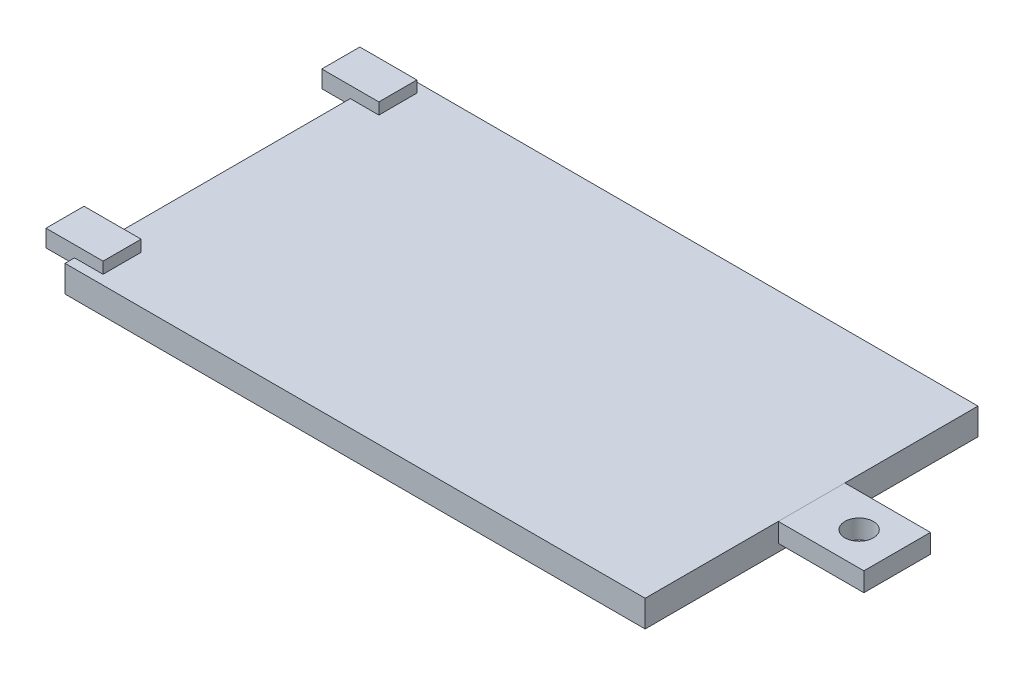
ISO-10303-21;
HEADER;
FILE_DESCRIPTION(('STEP AP214'),'2;1');
FILE_NAME('part.step','',(''),(''),'','','');
FILE_SCHEMA(('AUTOMOTIVE_DESIGN { 1 0 10303 214 1 1 1 1 }'));
ENDSEC;
DATA;
#1=APPLICATION_CONTEXT('core data for automotive mechanical design processes');
#2=APPLICATION_PROTOCOL_DEFINITION('international standard','automotive_design',2000,#1);
#3=PRODUCT_CONTEXT('',#1,'mechanical');
#4=PRODUCT('Part','Part','',(#3));
#5=PRODUCT_RELATED_PRODUCT_CATEGORY('part','',(#4));
#6=PRODUCT_DEFINITION_FORMATION('','',#4);
#7=PRODUCT_DEFINITION_CONTEXT('part definition',#1,'design');
#8=PRODUCT_DEFINITION('design','',#6,#7);
#9=PRODUCT_DEFINITION_SHAPE('','',#8);
#10=(LENGTH_UNIT() NAMED_UNIT(*) SI_UNIT(.MILLI.,.METRE.));
#11=(NAMED_UNIT(*) PLANE_ANGLE_UNIT() SI_UNIT($,.RADIAN.));
#12=(NAMED_UNIT(*) SI_UNIT($,.STERADIAN.) SOLID_ANGLE_UNIT());
#13=UNCERTAINTY_MEASURE_WITH_UNIT(LENGTH_MEASURE(1.E-05),#10,'distance_accuracy_value','');
#14=(GEOMETRIC_REPRESENTATION_CONTEXT(3) GLOBAL_UNCERTAINTY_ASSIGNED_CONTEXT((#13)) GLOBAL_UNIT_ASSIGNED_CONTEXT((#10,
#11,#12)) REPRESENTATION_CONTEXT('',''));
#15=CARTESIAN_POINT('',(0.,0.,0.));
#16=DIRECTION('',(0.,0.,1.));
#17=DIRECTION('',(1.,0.,0.));
#18=AXIS2_PLACEMENT_3D('',#15,#16,#17);
#19=CARTESIAN_POINT('',(0.,0.8,0.));
#20=DIRECTION('',(0.,1.,0.));
#21=DIRECTION('',(0.,0.,1.));
#22=AXIS2_PLACEMENT_3D('',#19,#20,#21);
#23=PLANE('',#22);
#24=DIRECTION('',(0.,0.,-1.));
#25=VECTOR('',#24,1.);
#26=CARTESIAN_POINT('',(61.,0.8,-21.));
#27=LINE('',#26,#25);
#28=CARTESIAN_POINT('',(61.,0.8,-14.));
#29=VERTEX_POINT('',#28);
#30=CARTESIAN_POINT('',(61.,0.8,-21.));
#31=VERTEX_POINT('',#30);
#32=EDGE_CURVE('E99',#29,#31,#27,.T.);
#33=ORIENTED_EDGE('',*,*,#32,.T.);
#34=DIRECTION('',(1.,0.,0.));
#35=VECTOR('',#34,1.);
#36=CARTESIAN_POINT('',(61.,0.8,-21.));
#37=LINE('',#36,#35);
#38=CARTESIAN_POINT('',(70.,0.8,-21.));
#39=VERTEX_POINT('',#38);
#40=EDGE_CURVE('E94',#31,#39,#37,.T.);
#41=ORIENTED_EDGE('',*,*,#40,.T.);
#42=DIRECTION('',(0.,0.,1.));
#43=VECTOR('',#42,1.);
#44=CARTESIAN_POINT('',(70.,0.8,-21.));
#45=LINE('',#44,#43);
#46=CARTESIAN_POINT('',(70.,0.8,-14.));
#47=VERTEX_POINT('',#46);
#48=EDGE_CURVE('E97',#39,#47,#45,.T.);
#49=ORIENTED_EDGE('',*,*,#48,.T.);
#50=DIRECTION('',(-1.,0.,0.));
#51=VECTOR('',#50,1.);
#52=CARTESIAN_POINT('',(61.,0.8,-14.));
#53=LINE('',#52,#51);
#54=EDGE_CURVE('E64',#47,#29,#53,.T.);
#55=ORIENTED_EDGE('',*,*,#54,.T.);
#56=EDGE_LOOP('',(#33,#41,#49,#55));
#57=FACE_BOUND('',#56,.T.);
#58=CARTESIAN_POINT('',(66.,0.8,-17.5));
#59=DIRECTION('',(0.,-1.,0.));
#60=DIRECTION('',(0.,0.,-1.));
#61=AXIS2_PLACEMENT_3D('',#58,#59,#60);
#62=CIRCLE('',#61,1.5);
#63=CARTESIAN_POINT('',(66.,0.8,-19.));
#64=VERTEX_POINT('',#63);
#65=EDGE_CURVE('E114',#64,#64,#62,.T.);
#66=ORIENTED_EDGE('',*,*,#65,.F.);
#67=EDGE_LOOP('',(#66));
#68=FACE_BOUND('',#67,.T.);
#69=ADVANCED_FACE('F47',(#57,#68),#23,.F.);
#70=CARTESIAN_POINT('',(0.,2.8,0.));
#71=DIRECTION('',(0.,1.,0.));
#72=DIRECTION('',(0.,0.,1.));
#73=AXIS2_PLACEMENT_3D('',#70,#71,#72);
#74=PLANE('',#73);
#75=DIRECTION('',(0.,0.,-1.));
#76=VECTOR('',#75,1.);
#77=CARTESIAN_POINT('',(61.,2.8,-21.));
#78=LINE('',#77,#76);
#79=CARTESIAN_POINT('',(61.,2.8,-14.));
#80=VERTEX_POINT('',#79);
#81=CARTESIAN_POINT('',(61.,2.8,-21.));
#82=VERTEX_POINT('',#81);
#83=EDGE_CURVE('E111',#80,#82,#78,.T.);
#84=ORIENTED_EDGE('',*,*,#83,.F.);
#85=DIRECTION('',(-1.,0.,0.));
#86=VECTOR('',#85,1.);
#87=CARTESIAN_POINT('',(61.,2.8,-14.));
#88=LINE('',#87,#86);
#89=CARTESIAN_POINT('',(70.,2.8,-14.));
#90=VERTEX_POINT('',#89);
#91=EDGE_CURVE('E87',#90,#80,#88,.T.);
#92=ORIENTED_EDGE('',*,*,#91,.F.);
#93=DIRECTION('',(0.,0.,1.));
#94=VECTOR('',#93,1.);
#95=CARTESIAN_POINT('',(70.,2.8,-21.));
#96=LINE('',#95,#94);
#97=CARTESIAN_POINT('',(70.,2.8,-21.));
#98=VERTEX_POINT('',#97);
#99=EDGE_CURVE('E81',#98,#90,#96,.T.);
#100=ORIENTED_EDGE('',*,*,#99,.F.);
#101=DIRECTION('',(1.,0.,0.));
#102=VECTOR('',#101,1.);
#103=CARTESIAN_POINT('',(61.,2.8,-21.));
#104=LINE('',#103,#102);
#105=EDGE_CURVE('E103',#82,#98,#104,.T.);
#106=ORIENTED_EDGE('',*,*,#105,.F.);
#107=EDGE_LOOP('',(#84,#92,#100,#106));
#108=FACE_BOUND('',#107,.T.);
#109=CARTESIAN_POINT('',(66.,2.8,-17.5));
#110=DIRECTION('',(0.,-1.,0.));
#111=DIRECTION('',(0.,0.,-1.));
#112=AXIS2_PLACEMENT_3D('',#109,#110,#111);
#113=CIRCLE('',#112,1.5);
#114=CARTESIAN_POINT('',(66.,2.8,-19.));
#115=VERTEX_POINT('',#114);
#116=EDGE_CURVE('E126',#115,#115,#113,.T.);
#117=ORIENTED_EDGE('',*,*,#116,.T.);
#118=EDGE_LOOP('',(#117));
#119=FACE_BOUND('',#118,.T.);
#120=ADVANCED_FACE('F122',(#108,#119),#74,.T.);
#121=CARTESIAN_POINT('',(61.,0.8,-21.));
#122=DIRECTION('',(1.,0.,0.));
#123=DIRECTION('',(0.,0.,-1.));
#124=AXIS2_PLACEMENT_3D('',#121,#122,#123);
#125=PLANE('',#124);
#126=ORIENTED_EDGE('',*,*,#83,.T.);
#127=DIRECTION('',(0.,1.,0.));
#128=VECTOR('',#127,1.);
#129=CARTESIAN_POINT('',(61.,0.8,-21.));
#130=LINE('',#129,#128);
#131=EDGE_CURVE('E12',#31,#82,#130,.T.);
#132=ORIENTED_EDGE('',*,*,#131,.F.);
#133=ORIENTED_EDGE('',*,*,#32,.F.);
#134=DIRECTION('',(0.,1.,0.));
#135=VECTOR('',#134,1.);
#136=CARTESIAN_POINT('',(61.,0.8,-14.));
#137=LINE('',#136,#135);
#138=EDGE_CURVE('E107',#29,#80,#137,.T.);
#139=ORIENTED_EDGE('',*,*,#138,.T.);
#140=EDGE_LOOP('',(#126,#132,#133,#139));
#141=FACE_BOUND('',#140,.T.);
#142=ADVANCED_FACE('F49',(#141),#125,.F.);
#143=CARTESIAN_POINT('',(61.,0.8,-21.));
#144=DIRECTION('',(0.,0.,1.));
#145=DIRECTION('',(1.,0.,0.));
#146=AXIS2_PLACEMENT_3D('',#143,#144,#145);
#147=PLANE('',#146);
#148=ORIENTED_EDGE('',*,*,#105,.T.);
#149=DIRECTION('',(0.,1.,0.));
#150=VECTOR('',#149,1.);
#151=CARTESIAN_POINT('',(70.,0.8,-21.));
#152=LINE('',#151,#150);
#153=EDGE_CURVE('E56',#39,#98,#152,.T.);
#154=ORIENTED_EDGE('',*,*,#153,.F.);
#155=ORIENTED_EDGE('',*,*,#40,.F.);
#156=ORIENTED_EDGE('',*,*,#131,.T.);
#157=EDGE_LOOP('',(#148,#154,#155,#156));
#158=FACE_BOUND('',#157,.T.);
#159=ADVANCED_FACE('F102',(#158),#147,.F.);
#160=CARTESIAN_POINT('',(70.,0.8,-21.));
#161=DIRECTION('',(-1.,0.,0.));
#162=DIRECTION('',(0.,0.,1.));
#163=AXIS2_PLACEMENT_3D('',#160,#161,#162);
#164=PLANE('',#163);
#165=ORIENTED_EDGE('',*,*,#99,.T.);
#166=DIRECTION('',(0.,1.,0.));
#167=VECTOR('',#166,1.);
#168=CARTESIAN_POINT('',(70.,0.8,-14.));
#169=LINE('',#168,#167);
#170=EDGE_CURVE('E104',#47,#90,#169,.T.);
#171=ORIENTED_EDGE('',*,*,#170,.F.);
#172=ORIENTED_EDGE('',*,*,#48,.F.);
#173=ORIENTED_EDGE('',*,*,#153,.T.);
#174=EDGE_LOOP('',(#165,#171,#172,#173));
#175=FACE_BOUND('',#174,.T.);
#176=ADVANCED_FACE('F105',(#175),#164,.F.);
#177=CARTESIAN_POINT('',(61.,0.8,-14.));
#178=DIRECTION('',(0.,0.,-1.));
#179=DIRECTION('',(-1.,0.,0.));
#180=AXIS2_PLACEMENT_3D('',#177,#178,#179);
#181=PLANE('',#180);
#182=ORIENTED_EDGE('',*,*,#91,.T.);
#183=ORIENTED_EDGE('',*,*,#138,.F.);
#184=ORIENTED_EDGE('',*,*,#54,.F.);
#185=ORIENTED_EDGE('',*,*,#170,.T.);
#186=EDGE_LOOP('',(#182,#183,#184,#185));
#187=FACE_BOUND('',#186,.T.);
#188=ADVANCED_FACE('F119',(#187),#181,.F.);
#189=CARTESIAN_POINT('',(66.,0.8,-17.5));
#190=DIRECTION('',(0.,1.,0.));
#191=DIRECTION('',(0.,0.,1.));
#192=AXIS2_PLACEMENT_3D('',#189,#190,#191);
#193=CYLINDRICAL_SURFACE('',#192,1.5);
#194=ORIENTED_EDGE('',*,*,#65,.T.);
#195=EDGE_LOOP('',(#194));
#196=FACE_BOUND('',#195,.T.);
#197=ORIENTED_EDGE('',*,*,#116,.F.);
#198=EDGE_LOOP('',(#197));
#199=FACE_BOUND('',#198,.T.);
#200=ADVANCED_FACE('F132',(#196,#199),#193,.F.);
#201=CLOSED_SHELL('',(#69,#120,#142,#159,#176,#188,#200));
#202=MANIFOLD_SOLID_BREP('B2',#201);
#203=CARTESIAN_POINT('',(0.,2.8,0.));
#204=DIRECTION('',(1.,0.,0.));
#205=DIRECTION('',(0.,0.,-1.));
#206=AXIS2_PLACEMENT_3D('',#203,#204,#205);
#207=PLANE('',#206);
#208=DIRECTION('',(0.,1.,0.));
#209=VECTOR('',#208,1.);
#210=CARTESIAN_POINT('',(0.,2.8,-30.));
#211=LINE('',#210,#209);
#212=CARTESIAN_POINT('',(0.,2.2,-30.));
#213=VERTEX_POINT('',#212);
#214=CARTESIAN_POINT('',(0.,2.8,-30.));
#215=VERTEX_POINT('',#214);
#216=EDGE_CURVE('E328',#213,#215,#211,.T.);
#217=ORIENTED_EDGE('',*,*,#216,.F.);
#218=DIRECTION('',(0.,0.,1.));
#219=VECTOR('',#218,1.);
#220=CARTESIAN_POINT('',(0.,2.2,0.));
#221=LINE('',#220,#219);
#222=CARTESIAN_POINT('',(0.,2.2,-34.));
#223=VERTEX_POINT('',#222);
#224=EDGE_CURVE('E45',#223,#213,#221,.T.);
#225=ORIENTED_EDGE('',*,*,#224,.F.);
#226=DIRECTION('',(0.,-1.,0.));
#227=VECTOR('',#226,1.);
#228=CARTESIAN_POINT('',(0.,2.8,-34.));
#229=LINE('',#228,#227);
#230=CARTESIAN_POINT('',(0.,2.8,-34.));
#231=VERTEX_POINT('',#230);
#232=EDGE_CURVE('E326',#231,#223,#229,.T.);
#233=ORIENTED_EDGE('',*,*,#232,.F.);
#234=DIRECTION('',(0.,0.,1.));
#235=VECTOR('',#234,1.);
#236=CARTESIAN_POINT('',(0.,2.8,0.));
#237=LINE('',#236,#235);
#238=CARTESIAN_POINT('',(0.,2.8,-35.));
#239=VERTEX_POINT('',#238);
#240=EDGE_CURVE('E369',#239,#231,#237,.T.);
#241=ORIENTED_EDGE('',*,*,#240,.F.);
#242=DIRECTION('',(0.,-1.,0.));
#243=VECTOR('',#242,1.);
#244=CARTESIAN_POINT('',(0.,2.8,-35.));
#245=LINE('',#244,#243);
#246=CARTESIAN_POINT('',(0.,0.,-35.));
#247=VERTEX_POINT('',#246);
#248=EDGE_CURVE('E380',#239,#247,#245,.T.);
#249=ORIENTED_EDGE('',*,*,#248,.T.);
#250=DIRECTION('',(0.,0.,1.));
#251=VECTOR('',#250,1.);
#252=CARTESIAN_POINT('',(0.,0.,0.));
#253=LINE('',#252,#251);
#254=CARTESIAN_POINT('',(0.,0.,0.));
#255=VERTEX_POINT('',#254);
#256=EDGE_CURVE('E368',#247,#255,#253,.T.);
#257=ORIENTED_EDGE('',*,*,#256,.T.);
#258=DIRECTION('',(0.,-1.,0.));
#259=VECTOR('',#258,1.);
#260=CARTESIAN_POINT('',(0.,2.8,0.));
#261=LINE('',#260,#259);
#262=CARTESIAN_POINT('',(0.,2.8,0.));
#263=VERTEX_POINT('',#262);
#264=EDGE_CURVE('E397',#263,#255,#261,.T.);
#265=ORIENTED_EDGE('',*,*,#264,.F.);
#266=CARTESIAN_POINT('',(0.,2.8,-1.));
#267=VERTEX_POINT('',#266);
#268=EDGE_CURVE('E374',#267,#263,#237,.T.);
#269=ORIENTED_EDGE('',*,*,#268,.F.);
#270=DIRECTION('',(0.,1.,0.));
#271=VECTOR('',#270,1.);
#272=CARTESIAN_POINT('',(0.,2.8,-1.));
#273=LINE('',#272,#271);
#274=CARTESIAN_POINT('',(0.,2.2,-1.));
#275=VERTEX_POINT('',#274);
#276=EDGE_CURVE('E363',#275,#267,#273,.T.);
#277=ORIENTED_EDGE('',*,*,#276,.F.);
#278=DIRECTION('',(0.,0.,1.));
#279=VECTOR('',#278,1.);
#280=CARTESIAN_POINT('',(0.,2.2,0.));
#281=LINE('',#280,#279);
#282=CARTESIAN_POINT('',(0.,2.2,-5.));
#283=VERTEX_POINT('',#282);
#284=EDGE_CURVE('E214',#283,#275,#281,.T.);
#285=ORIENTED_EDGE('',*,*,#284,.F.);
#286=DIRECTION('',(0.,-1.,0.));
#287=VECTOR('',#286,1.);
#288=CARTESIAN_POINT('',(0.,2.8,-5.));
#289=LINE('',#288,#287);
#290=CARTESIAN_POINT('',(0.,2.8,-5.));
#291=VERTEX_POINT('',#290);
#292=EDGE_CURVE('E366',#291,#283,#289,.T.);
#293=ORIENTED_EDGE('',*,*,#292,.F.);
#294=EDGE_CURVE('E373',#215,#291,#237,.T.);
#295=ORIENTED_EDGE('',*,*,#294,.F.);
#296=EDGE_LOOP('',(#217,#225,#233,#241,#249,#257,#265,#269,#277,#285,#293,#295));
#297=FACE_BOUND('',#296,.T.);
#298=ADVANCED_FACE('F192',(#297),#207,.F.);
#299=CARTESIAN_POINT('',(0.,2.8,0.));
#300=DIRECTION('',(0.,-1.,0.));
#301=DIRECTION('',(0.,0.,-1.));
#302=AXIS2_PLACEMENT_3D('',#299,#300,#301);
#303=PLANE('',#302);
#304=DIRECTION('',(1.,0.,0.));
#305=VECTOR('',#304,1.);
#306=CARTESIAN_POINT('',(0.,2.8,-30.));
#307=LINE('',#306,#305);
#308=CARTESIAN_POINT('',(3.,2.8,-30.));
#309=VERTEX_POINT('',#308);
#310=EDGE_CURVE('E199',#215,#309,#307,.T.);
#311=ORIENTED_EDGE('',*,*,#310,.F.);
#312=ORIENTED_EDGE('',*,*,#294,.T.);
#313=DIRECTION('',(-1.,0.,0.));
#314=VECTOR('',#313,1.);
#315=CARTESIAN_POINT('',(0.,2.8,-5.));
#316=LINE('',#315,#314);
#317=CARTESIAN_POINT('',(3.,2.8,-5.));
#318=VERTEX_POINT('',#317);
#319=EDGE_CURVE('E406',#318,#291,#316,.T.);
#320=ORIENTED_EDGE('',*,*,#319,.F.);
#321=DIRECTION('',(0.,0.,-1.));
#322=VECTOR('',#321,1.);
#323=CARTESIAN_POINT('',(3.,2.8,0.));
#324=LINE('',#323,#322);
#325=CARTESIAN_POINT('',(3.,2.8,-1.));
#326=VERTEX_POINT('',#325);
#327=EDGE_CURVE('E400',#326,#318,#324,.T.);
#328=ORIENTED_EDGE('',*,*,#327,.F.);
#329=DIRECTION('',(1.,0.,0.));
#330=VECTOR('',#329,1.);
#331=CARTESIAN_POINT('',(0.,2.8,-1.));
#332=LINE('',#331,#330);
#333=EDGE_CURVE('E403',#267,#326,#332,.T.);
#334=ORIENTED_EDGE('',*,*,#333,.F.);
#335=ORIENTED_EDGE('',*,*,#268,.T.);
#336=DIRECTION('',(1.,0.,0.));
#337=VECTOR('',#336,1.);
#338=CARTESIAN_POINT('',(0.,2.8,0.));
#339=LINE('',#338,#337);
#340=CARTESIAN_POINT('',(61.,2.8,0.));
#341=VERTEX_POINT('',#340);
#342=EDGE_CURVE('E372',#263,#341,#339,.T.);
#343=ORIENTED_EDGE('',*,*,#342,.T.);
#344=DIRECTION('',(0.,0.,-1.));
#345=VECTOR('',#344,1.);
#346=CARTESIAN_POINT('',(61.,2.8,0.));
#347=LINE('',#346,#345);
#348=CARTESIAN_POINT('',(61.,2.8,-35.));
#349=VERTEX_POINT('',#348);
#350=EDGE_CURVE('E376',#341,#349,#347,.T.);
#351=ORIENTED_EDGE('',*,*,#350,.T.);
#352=DIRECTION('',(-1.,0.,0.));
#353=VECTOR('',#352,1.);
#354=CARTESIAN_POINT('',(0.,2.8,-35.));
#355=LINE('',#354,#353);
#356=EDGE_CURVE('E378',#349,#239,#355,.T.);
#357=ORIENTED_EDGE('',*,*,#356,.T.);
#358=ORIENTED_EDGE('',*,*,#240,.T.);
#359=DIRECTION('',(-1.,0.,0.));
#360=VECTOR('',#359,1.);
#361=CARTESIAN_POINT('',(0.,2.8,-34.));
#362=LINE('',#361,#360);
#363=CARTESIAN_POINT('',(3.,2.8,-34.));
#364=VERTEX_POINT('',#363);
#365=EDGE_CURVE('E413',#364,#231,#362,.T.);
#366=ORIENTED_EDGE('',*,*,#365,.F.);
#367=DIRECTION('',(0.,0.,1.));
#368=VECTOR('',#367,1.);
#369=CARTESIAN_POINT('',(3.,2.8,0.));
#370=LINE('',#369,#368);
#371=EDGE_CURVE('E410',#364,#309,#370,.T.);
#372=ORIENTED_EDGE('',*,*,#371,.T.);
#373=EDGE_LOOP('',(#311,#312,#320,#328,#334,#335,#343,#351,#357,#358,#366,#372));
#374=FACE_BOUND('',#373,.T.);
#375=ADVANCED_FACE('F419',(#374),#303,.F.);
#376=CARTESIAN_POINT('',(0.,2.8,0.));
#377=DIRECTION('',(0.,0.,-1.));
#378=DIRECTION('',(-1.,0.,0.));
#379=AXIS2_PLACEMENT_3D('',#376,#377,#378);
#380=PLANE('',#379);
#381=DIRECTION('',(1.,0.,0.));
#382=VECTOR('',#381,1.);
#383=CARTESIAN_POINT('',(0.,0.,0.));
#384=LINE('',#383,#382);
#385=CARTESIAN_POINT('',(61.,0.,0.));
#386=VERTEX_POINT('',#385);
#387=EDGE_CURVE('E383',#255,#386,#384,.T.);
#388=ORIENTED_EDGE('',*,*,#387,.T.);
#389=DIRECTION('',(0.,-1.,0.));
#390=VECTOR('',#389,1.);
#391=CARTESIAN_POINT('',(61.,2.8,0.));
#392=LINE('',#391,#390);
#393=EDGE_CURVE('E394',#341,#386,#392,.T.);
#394=ORIENTED_EDGE('',*,*,#393,.F.);
#395=ORIENTED_EDGE('',*,*,#342,.F.);
#396=ORIENTED_EDGE('',*,*,#264,.T.);
#397=EDGE_LOOP('',(#388,#394,#395,#396));
#398=FACE_BOUND('',#397,.T.);
#399=ADVANCED_FACE('F443',(#398),#380,.F.);
#400=CARTESIAN_POINT('',(61.,2.8,0.));
#401=DIRECTION('',(-1.,0.,0.));
#402=DIRECTION('',(0.,0.,1.));
#403=AXIS2_PLACEMENT_3D('',#400,#401,#402);
#404=PLANE('',#403);
#405=DIRECTION('',(0.,0.,-1.));
#406=VECTOR('',#405,1.);
#407=CARTESIAN_POINT('',(61.,0.,0.));
#408=LINE('',#407,#406);
#409=CARTESIAN_POINT('',(61.,0.,-35.));
#410=VERTEX_POINT('',#409);
#411=EDGE_CURVE('E385',#386,#410,#408,.T.);
#412=ORIENTED_EDGE('',*,*,#411,.T.);
#413=DIRECTION('',(0.,-1.,0.));
#414=VECTOR('',#413,1.);
#415=CARTESIAN_POINT('',(61.,2.8,-35.));
#416=LINE('',#415,#414);
#417=EDGE_CURVE('E391',#349,#410,#416,.T.);
#418=ORIENTED_EDGE('',*,*,#417,.F.);
#419=ORIENTED_EDGE('',*,*,#350,.F.);
#420=ORIENTED_EDGE('',*,*,#393,.T.);
#421=EDGE_LOOP('',(#412,#418,#419,#420));
#422=FACE_BOUND('',#421,.T.);
#423=ADVANCED_FACE('F452',(#422),#404,.F.);
#424=CARTESIAN_POINT('',(0.,2.8,-35.));
#425=DIRECTION('',(0.,0.,1.));
#426=DIRECTION('',(1.,0.,0.));
#427=AXIS2_PLACEMENT_3D('',#424,#425,#426);
#428=PLANE('',#427);
#429=DIRECTION('',(-1.,0.,0.));
#430=VECTOR('',#429,1.);
#431=CARTESIAN_POINT('',(0.,0.,-35.));
#432=LINE('',#431,#430);
#433=EDGE_CURVE('E387',#410,#247,#432,.T.);
#434=ORIENTED_EDGE('',*,*,#433,.T.);
#435=ORIENTED_EDGE('',*,*,#248,.F.);
#436=ORIENTED_EDGE('',*,*,#356,.F.);
#437=ORIENTED_EDGE('',*,*,#417,.T.);
#438=EDGE_LOOP('',(#434,#435,#436,#437));
#439=FACE_BOUND('',#438,.T.);
#440=ADVANCED_FACE('F456',(#439),#428,.F.);
#441=CARTESIAN_POINT('',(0.,0.,0.));
#442=DIRECTION('',(0.,-1.,0.));
#443=DIRECTION('',(0.,0.,-1.));
#444=AXIS2_PLACEMENT_3D('',#441,#442,#443);
#445=PLANE('',#444);
#446=ORIENTED_EDGE('',*,*,#256,.F.);
#447=ORIENTED_EDGE('',*,*,#433,.F.);
#448=ORIENTED_EDGE('',*,*,#411,.F.);
#449=ORIENTED_EDGE('',*,*,#387,.F.);
#450=EDGE_LOOP('',(#446,#447,#448,#449));
#451=FACE_BOUND('',#450,.T.);
#452=ADVANCED_FACE('F449',(#451),#445,.T.);
#453=CARTESIAN_POINT('',(-3.,2.2,-5.));
#454=DIRECTION('',(0.,1.,0.));
#455=DIRECTION('',(0.,0.,1.));
#456=AXIS2_PLACEMENT_3D('',#453,#454,#455);
#457=PLANE('',#456);
#458=DIRECTION('',(1.,0.,0.));
#459=VECTOR('',#458,1.);
#460=CARTESIAN_POINT('',(-3.,2.2,-5.));
#461=LINE('',#460,#459);
#462=CARTESIAN_POINT('',(-3.,2.2,-5.));
#463=VERTEX_POINT('',#462);
#464=EDGE_CURVE('E360',#463,#283,#461,.T.);
#465=ORIENTED_EDGE('',*,*,#464,.T.);
#466=ORIENTED_EDGE('',*,*,#284,.T.);
#467=DIRECTION('',(1.,0.,0.));
#468=VECTOR('',#467,1.);
#469=CARTESIAN_POINT('',(-3.,2.2,-1.));
#470=LINE('',#469,#468);
#471=CARTESIAN_POINT('',(-3.,2.2,-1.));
#472=VERTEX_POINT('',#471);
#473=EDGE_CURVE('E357',#472,#275,#470,.T.);
#474=ORIENTED_EDGE('',*,*,#473,.F.);
#475=DIRECTION('',(0.,0.,1.));
#476=VECTOR('',#475,1.);
#477=CARTESIAN_POINT('',(-3.,2.2,-5.));
#478=LINE('',#477,#476);
#479=EDGE_CURVE('E339',#463,#472,#478,.T.);
#480=ORIENTED_EDGE('',*,*,#479,.F.);
#481=EDGE_LOOP('',(#465,#466,#474,#480));
#482=FACE_BOUND('',#481,.T.);
#483=ADVANCED_FACE('F463',(#482),#457,.F.);
#484=CARTESIAN_POINT('',(-3.,4.,-5.));
#485=DIRECTION('',(0.,0.,1.));
#486=DIRECTION('',(0.,-1.,0.));
#487=AXIS2_PLACEMENT_3D('',#484,#485,#486);
#488=PLANE('',#487);
#489=ORIENTED_EDGE('',*,*,#319,.T.);
#490=ORIENTED_EDGE('',*,*,#292,.T.);
#491=ORIENTED_EDGE('',*,*,#464,.F.);
#492=DIRECTION('',(0.,-1.,0.));
#493=VECTOR('',#492,1.);
#494=CARTESIAN_POINT('',(-3.,4.,-5.));
#495=LINE('',#494,#493);
#496=CARTESIAN_POINT('',(-3.,4.,-5.));
#497=VERTEX_POINT('',#496);
#498=EDGE_CURVE('E336',#497,#463,#495,.T.);
#499=ORIENTED_EDGE('',*,*,#498,.F.);
#500=DIRECTION('',(1.,0.,0.));
#501=VECTOR('',#500,1.);
#502=CARTESIAN_POINT('',(-3.,4.,-5.));
#503=LINE('',#502,#501);
#504=CARTESIAN_POINT('',(3.,4.,-5.));
#505=VERTEX_POINT('',#504);
#506=EDGE_CURVE('E346',#497,#505,#503,.T.);
#507=ORIENTED_EDGE('',*,*,#506,.T.);
#508=DIRECTION('',(0.,-1.,0.));
#509=VECTOR('',#508,1.);
#510=CARTESIAN_POINT('',(3.,4.,-5.));
#511=LINE('',#510,#509);
#512=EDGE_CURVE('E335',#505,#318,#511,.T.);
#513=ORIENTED_EDGE('',*,*,#512,.T.);
#514=EDGE_LOOP('',(#489,#490,#491,#499,#507,#513));
#515=FACE_BOUND('',#514,.T.);
#516=ADVANCED_FACE('F475',(#515),#488,.F.);
#517=CARTESIAN_POINT('',(-3.,4.,-1.));
#518=DIRECTION('',(0.,0.,-1.));
#519=DIRECTION('',(-1.,0.,0.));
#520=AXIS2_PLACEMENT_3D('',#517,#518,#519);
#521=PLANE('',#520);
#522=ORIENTED_EDGE('',*,*,#473,.T.);
#523=ORIENTED_EDGE('',*,*,#276,.T.);
#524=ORIENTED_EDGE('',*,*,#333,.T.);
#525=DIRECTION('',(0.,1.,0.));
#526=VECTOR('',#525,1.);
#527=CARTESIAN_POINT('',(3.,4.,-1.));
#528=LINE('',#527,#526);
#529=CARTESIAN_POINT('',(3.,4.,-1.));
#530=VERTEX_POINT('',#529);
#531=EDGE_CURVE('E349',#326,#530,#528,.T.);
#532=ORIENTED_EDGE('',*,*,#531,.T.);
#533=DIRECTION('',(1.,0.,0.));
#534=VECTOR('',#533,1.);
#535=CARTESIAN_POINT('',(-3.,4.,-1.));
#536=LINE('',#535,#534);
#537=CARTESIAN_POINT('',(-3.,4.,-1.));
#538=VERTEX_POINT('',#537);
#539=EDGE_CURVE('E354',#538,#530,#536,.T.);
#540=ORIENTED_EDGE('',*,*,#539,.F.);
#541=DIRECTION('',(0.,1.,0.));
#542=VECTOR('',#541,1.);
#543=CARTESIAN_POINT('',(-3.,4.,-1.));
#544=LINE('',#543,#542);
#545=EDGE_CURVE('E342',#472,#538,#544,.T.);
#546=ORIENTED_EDGE('',*,*,#545,.F.);
#547=EDGE_LOOP('',(#522,#523,#524,#532,#540,#546));
#548=FACE_BOUND('',#547,.T.);
#549=ADVANCED_FACE('F478',(#548),#521,.F.);
#550=CARTESIAN_POINT('',(3.,0.,0.));
#551=DIRECTION('',(-1.,0.,0.));
#552=DIRECTION('',(0.,0.,1.));
#553=AXIS2_PLACEMENT_3D('',#550,#551,#552);
#554=PLANE('',#553);
#555=ORIENTED_EDGE('',*,*,#531,.F.);
#556=ORIENTED_EDGE('',*,*,#327,.T.);
#557=ORIENTED_EDGE('',*,*,#512,.F.);
#558=DIRECTION('',(0.,0.,-1.));
#559=VECTOR('',#558,1.);
#560=CARTESIAN_POINT('',(3.,4.,-5.));
#561=LINE('',#560,#559);
#562=EDGE_CURVE('E340',#530,#505,#561,.T.);
#563=ORIENTED_EDGE('',*,*,#562,.F.);
#564=EDGE_LOOP('',(#555,#556,#557,#563));
#565=FACE_BOUND('',#564,.T.);
#566=ADVANCED_FACE('F485',(#565),#554,.F.);
#567=CARTESIAN_POINT('',(-3.,4.,-5.));
#568=DIRECTION('',(0.,-1.,0.));
#569=DIRECTION('',(0.,0.,-1.));
#570=AXIS2_PLACEMENT_3D('',#567,#568,#569);
#571=PLANE('',#570);
#572=ORIENTED_EDGE('',*,*,#562,.T.);
#573=ORIENTED_EDGE('',*,*,#506,.F.);
#574=DIRECTION('',(0.,0.,-1.));
#575=VECTOR('',#574,1.);
#576=CARTESIAN_POINT('',(-3.,4.,-5.));
#577=LINE('',#576,#575);
#578=EDGE_CURVE('E344',#538,#497,#577,.T.);
#579=ORIENTED_EDGE('',*,*,#578,.F.);
#580=ORIENTED_EDGE('',*,*,#539,.T.);
#581=EDGE_LOOP('',(#572,#573,#579,#580));
#582=FACE_BOUND('',#581,.T.);
#583=ADVANCED_FACE('F487',(#582),#571,.F.);
#584=CARTESIAN_POINT('',(-3.,0.,0.));
#585=DIRECTION('',(-1.,0.,0.));
#586=DIRECTION('',(0.,0.,1.));
#587=AXIS2_PLACEMENT_3D('',#584,#585,#586);
#588=PLANE('',#587);
#589=ORIENTED_EDGE('',*,*,#498,.T.);
#590=ORIENTED_EDGE('',*,*,#479,.T.);
#591=ORIENTED_EDGE('',*,*,#545,.T.);
#592=ORIENTED_EDGE('',*,*,#578,.T.);
#593=EDGE_LOOP('',(#589,#590,#591,#592));
#594=FACE_BOUND('',#593,.T.);
#595=ADVANCED_FACE('F490',(#594),#588,.T.);
#596=CARTESIAN_POINT('',(-3.,2.2,-30.));
#597=DIRECTION('',(0.,1.,0.));
#598=DIRECTION('',(0.,0.,1.));
#599=AXIS2_PLACEMENT_3D('',#596,#597,#598);
#600=PLANE('',#599);
#601=DIRECTION('',(1.,0.,0.));
#602=VECTOR('',#601,1.);
#603=CARTESIAN_POINT('',(-3.,2.2,-34.));
#604=LINE('',#603,#602);
#605=CARTESIAN_POINT('',(-3.,2.2,-34.));
#606=VERTEX_POINT('',#605);
#607=EDGE_CURVE('E330',#606,#223,#604,.T.);
#608=ORIENTED_EDGE('',*,*,#607,.T.);
#609=ORIENTED_EDGE('',*,*,#224,.T.);
#610=DIRECTION('',(1.,0.,0.));
#611=VECTOR('',#610,1.);
#612=CARTESIAN_POINT('',(-3.,2.2,-30.));
#613=LINE('',#612,#611);
#614=CARTESIAN_POINT('',(-3.,2.2,-30.));
#615=VERTEX_POINT('',#614);
#616=EDGE_CURVE('E431',#615,#213,#613,.T.);
#617=ORIENTED_EDGE('',*,*,#616,.F.);
#618=DIRECTION('',(0.,0.,1.));
#619=VECTOR('',#618,1.);
#620=CARTESIAN_POINT('',(-3.,2.2,-30.));
#621=LINE('',#620,#619);
#622=EDGE_CURVE('E319',#606,#615,#621,.T.);
#623=ORIENTED_EDGE('',*,*,#622,.F.);
#624=EDGE_LOOP('',(#608,#609,#617,#623));
#625=FACE_BOUND('',#624,.T.);
#626=ADVANCED_FACE('F436',(#625),#600,.F.);
#627=CARTESIAN_POINT('',(-3.,4.,-30.));
#628=DIRECTION('',(0.,0.,-1.));
#629=DIRECTION('',(-1.,0.,0.));
#630=AXIS2_PLACEMENT_3D('',#627,#628,#629);
#631=PLANE('',#630);
#632=ORIENTED_EDGE('',*,*,#616,.T.);
#633=ORIENTED_EDGE('',*,*,#216,.T.);
#634=ORIENTED_EDGE('',*,*,#310,.T.);
#635=DIRECTION('',(0.,1.,0.));
#636=VECTOR('',#635,1.);
#637=CARTESIAN_POINT('',(3.,4.,-30.));
#638=LINE('',#637,#636);
#639=CARTESIAN_POINT('',(3.,4.,-30.));
#640=VERTEX_POINT('',#639);
#641=EDGE_CURVE('E206',#309,#640,#638,.T.);
#642=ORIENTED_EDGE('',*,*,#641,.T.);
#643=DIRECTION('',(1.,0.,0.));
#644=VECTOR('',#643,1.);
#645=CARTESIAN_POINT('',(-3.,4.,-30.));
#646=LINE('',#645,#644);
#647=CARTESIAN_POINT('',(-3.,4.,-30.));
#648=VERTEX_POINT('',#647);
#649=EDGE_CURVE('E308',#648,#640,#646,.T.);
#650=ORIENTED_EDGE('',*,*,#649,.F.);
#651=DIRECTION('',(0.,1.,0.));
#652=VECTOR('',#651,1.);
#653=CARTESIAN_POINT('',(-3.,4.,-30.));
#654=LINE('',#653,#652);
#655=EDGE_CURVE('E314',#615,#648,#654,.T.);
#656=ORIENTED_EDGE('',*,*,#655,.F.);
#657=EDGE_LOOP('',(#632,#633,#634,#642,#650,#656));
#658=FACE_BOUND('',#657,.T.);
#659=ADVANCED_FACE('F325',(#658),#631,.F.);
#660=CARTESIAN_POINT('',(-3.,4.,-34.));
#661=DIRECTION('',(0.,0.,1.));
#662=DIRECTION('',(1.,0.,0.));
#663=AXIS2_PLACEMENT_3D('',#660,#661,#662);
#664=PLANE('',#663);
#665=ORIENTED_EDGE('',*,*,#365,.T.);
#666=ORIENTED_EDGE('',*,*,#232,.T.);
#667=ORIENTED_EDGE('',*,*,#607,.F.);
#668=DIRECTION('',(0.,-1.,0.));
#669=VECTOR('',#668,1.);
#670=CARTESIAN_POINT('',(-3.,4.,-34.));
#671=LINE('',#670,#669);
#672=CARTESIAN_POINT('',(-3.,4.,-34.));
#673=VERTEX_POINT('',#672);
#674=EDGE_CURVE('E313',#673,#606,#671,.T.);
#675=ORIENTED_EDGE('',*,*,#674,.F.);
#676=DIRECTION('',(1.,0.,0.));
#677=VECTOR('',#676,1.);
#678=CARTESIAN_POINT('',(-3.,4.,-34.));
#679=LINE('',#678,#677);
#680=CARTESIAN_POINT('',(3.,4.,-34.));
#681=VERTEX_POINT('',#680);
#682=EDGE_CURVE('E310',#673,#681,#679,.T.);
#683=ORIENTED_EDGE('',*,*,#682,.T.);
#684=DIRECTION('',(0.,-1.,0.));
#685=VECTOR('',#684,1.);
#686=CARTESIAN_POINT('',(3.,4.,-34.));
#687=LINE('',#686,#685);
#688=EDGE_CURVE('E323',#681,#364,#687,.T.);
#689=ORIENTED_EDGE('',*,*,#688,.T.);
#690=EDGE_LOOP('',(#665,#666,#667,#675,#683,#689));
#691=FACE_BOUND('',#690,.T.);
#692=ADVANCED_FACE('F424',(#691),#664,.F.);
#693=CARTESIAN_POINT('',(3.,0.,0.));
#694=DIRECTION('',(1.,0.,0.));
#695=DIRECTION('',(0.,0.,-1.));
#696=AXIS2_PLACEMENT_3D('',#693,#694,#695);
#697=PLANE('',#696);
#698=ORIENTED_EDGE('',*,*,#371,.F.);
#699=ORIENTED_EDGE('',*,*,#688,.F.);
#700=DIRECTION('',(0.,0.,-1.));
#701=VECTOR('',#700,1.);
#702=CARTESIAN_POINT('',(3.,4.,-30.));
#703=LINE('',#702,#701);
#704=EDGE_CURVE('E426',#640,#681,#703,.T.);
#705=ORIENTED_EDGE('',*,*,#704,.F.);
#706=ORIENTED_EDGE('',*,*,#641,.F.);
#707=EDGE_LOOP('',(#698,#699,#705,#706));
#708=FACE_BOUND('',#707,.T.);
#709=ADVANCED_FACE('F422',(#708),#697,.T.);
#710=CARTESIAN_POINT('',(-3.,4.,-30.));
#711=DIRECTION('',(0.,-1.,0.));
#712=DIRECTION('',(0.,0.,-1.));
#713=AXIS2_PLACEMENT_3D('',#710,#711,#712);
#714=PLANE('',#713);
#715=ORIENTED_EDGE('',*,*,#704,.T.);
#716=ORIENTED_EDGE('',*,*,#682,.F.);
#717=DIRECTION('',(0.,0.,-1.));
#718=VECTOR('',#717,1.);
#719=CARTESIAN_POINT('',(-3.,4.,-30.));
#720=LINE('',#719,#718);
#721=EDGE_CURVE('E304',#648,#673,#720,.T.);
#722=ORIENTED_EDGE('',*,*,#721,.F.);
#723=ORIENTED_EDGE('',*,*,#649,.T.);
#724=EDGE_LOOP('',(#715,#716,#722,#723));
#725=FACE_BOUND('',#724,.T.);
#726=ADVANCED_FACE('F306',(#725),#714,.F.);
#727=CARTESIAN_POINT('',(-3.,0.,0.));
#728=DIRECTION('',(1.,0.,0.));
#729=DIRECTION('',(0.,0.,-1.));
#730=AXIS2_PLACEMENT_3D('',#727,#728,#729);
#731=PLANE('',#730);
#732=ORIENTED_EDGE('',*,*,#655,.T.);
#733=ORIENTED_EDGE('',*,*,#721,.T.);
#734=ORIENTED_EDGE('',*,*,#674,.T.);
#735=ORIENTED_EDGE('',*,*,#622,.T.);
#736=EDGE_LOOP('',(#732,#733,#734,#735));
#737=FACE_BOUND('',#736,.T.);
#738=ADVANCED_FACE('F317',(#737),#731,.F.);
#739=CLOSED_SHELL('',(#298,#375,#399,#423,#440,#452,#483,#516,#549,#566,#583,#595,#626,#659,
#692,#709,#726,#738));
#740=MANIFOLD_SOLID_BREP('B6',#739);
#741=ADVANCED_BREP_SHAPE_REPRESENTATION('',(#18,#202,#740),#14);
#742=SHAPE_DEFINITION_REPRESENTATION(#9,#741);
ENDSEC;
END-ISO-10303-21;
